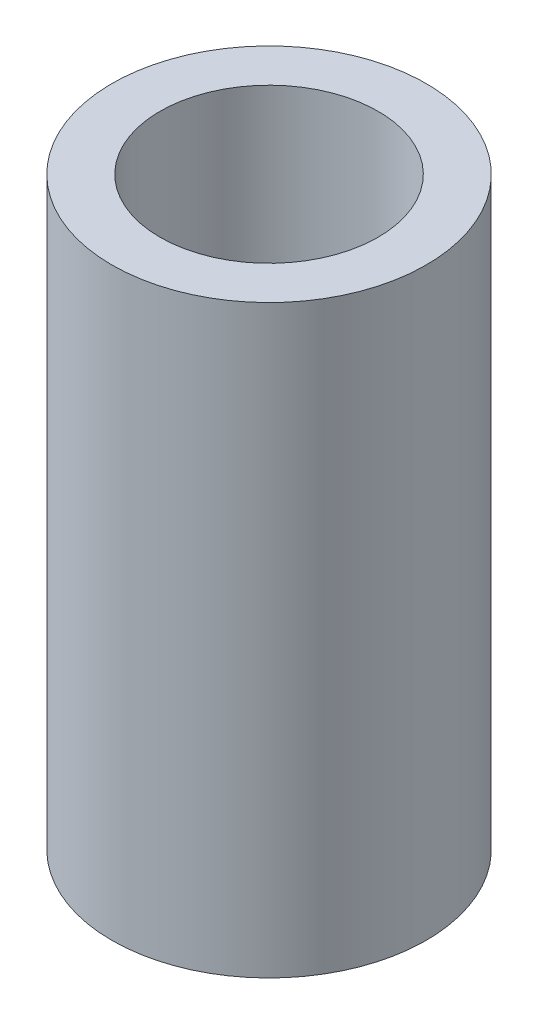
ISO-10303-21;
HEADER;
FILE_DESCRIPTION(('STEP AP214'),'2;1');
FILE_NAME('part.step','',(''),(''),'','','');
FILE_SCHEMA(('AUTOMOTIVE_DESIGN { 1 0 10303 214 1 1 1 1 }'));
ENDSEC;
DATA;
#1=APPLICATION_CONTEXT('core data for automotive mechanical design processes');
#2=APPLICATION_PROTOCOL_DEFINITION('international standard','automotive_design',2000,#1);
#3=PRODUCT_CONTEXT('',#1,'mechanical');
#4=PRODUCT('Part','Part','',(#3));
#5=PRODUCT_RELATED_PRODUCT_CATEGORY('part','',(#4));
#6=PRODUCT_DEFINITION_FORMATION('','',#4);
#7=PRODUCT_DEFINITION_CONTEXT('part definition',#1,'design');
#8=PRODUCT_DEFINITION('design','',#6,#7);
#9=PRODUCT_DEFINITION_SHAPE('','',#8);
#10=(LENGTH_UNIT() NAMED_UNIT(*) SI_UNIT(.MILLI.,.METRE.));
#11=(NAMED_UNIT(*) PLANE_ANGLE_UNIT() SI_UNIT($,.RADIAN.));
#12=(NAMED_UNIT(*) SI_UNIT($,.STERADIAN.) SOLID_ANGLE_UNIT());
#13=UNCERTAINTY_MEASURE_WITH_UNIT(LENGTH_MEASURE(1.E-05),#10,'distance_accuracy_value','');
#14=(GEOMETRIC_REPRESENTATION_CONTEXT(3) GLOBAL_UNCERTAINTY_ASSIGNED_CONTEXT((#13)) GLOBAL_UNIT_ASSIGNED_CONTEXT((#10,
#11,#12)) REPRESENTATION_CONTEXT('',''));
#15=CARTESIAN_POINT('',(0.,0.,0.));
#16=DIRECTION('',(0.,0.,1.));
#17=DIRECTION('',(1.,0.,0.));
#18=AXIS2_PLACEMENT_3D('',#15,#16,#17);
#19=CARTESIAN_POINT('',(0.,46.5232520482608,0.));
#20=DIRECTION('',(0.,-1.,0.));
#21=DIRECTION('',(0.,0.,-1.));
#22=AXIS2_PLACEMENT_3D('',#19,#20,#21);
#23=CYLINDRICAL_SURFACE('',#22,12.5);
#24=CARTESIAN_POINT('',(0.,46.5232520482608,0.));
#25=DIRECTION('',(0.,1.,0.));
#26=DIRECTION('',(0.,0.,1.));
#27=AXIS2_PLACEMENT_3D('',#24,#25,#26);
#28=CIRCLE('',#27,12.5);
#29=CARTESIAN_POINT('',(0.,46.5232520482608,12.5));
#30=VERTEX_POINT('',#29);
#31=EDGE_CURVE('E10',#30,#30,#28,.T.);
#32=ORIENTED_EDGE('',*,*,#31,.F.);
#33=EDGE_LOOP('',(#32));
#34=FACE_BOUND('',#33,.T.);
#35=CARTESIAN_POINT('',(0.,0.,0.));
#36=DIRECTION('',(0.,1.,0.));
#37=DIRECTION('',(0.,0.,1.));
#38=AXIS2_PLACEMENT_3D('',#35,#36,#37);
#39=CIRCLE('',#38,12.5);
#40=CARTESIAN_POINT('',(0.,0.,12.5));
#41=VERTEX_POINT('',#40);
#42=EDGE_CURVE('E37',#41,#41,#39,.T.);
#43=ORIENTED_EDGE('',*,*,#42,.T.);
#44=EDGE_LOOP('',(#43));
#45=FACE_BOUND('',#44,.T.);
#46=ADVANCED_FACE('F40',(#34,#45),#23,.T.);
#47=CARTESIAN_POINT('',(0.,46.5232520482608,0.));
#48=DIRECTION('',(0.,1.,0.));
#49=DIRECTION('',(0.,0.,1.));
#50=AXIS2_PLACEMENT_3D('',#47,#48,#49);
#51=PLANE('',#50);
#52=CARTESIAN_POINT('',(0.,46.5232520482608,0.));
#53=DIRECTION('',(0.,1.,0.));
#54=DIRECTION('',(0.,0.,1.));
#55=AXIS2_PLACEMENT_3D('',#52,#53,#54);
#56=CIRCLE('',#55,8.67770806605417);
#57=CARTESIAN_POINT('',(0.,46.5232520482608,8.67770806605417));
#58=VERTEX_POINT('',#57);
#59=EDGE_CURVE('E50',#58,#58,#56,.T.);
#60=ORIENTED_EDGE('',*,*,#59,.F.);
#61=EDGE_LOOP('',(#60));
#62=FACE_BOUND('',#61,.T.);
#63=ORIENTED_EDGE('',*,*,#31,.T.);
#64=EDGE_LOOP('',(#63));
#65=FACE_BOUND('',#64,.T.);
#66=ADVANCED_FACE('F59',(#62,#65),#51,.T.);
#67=CARTESIAN_POINT('',(0.,0.,0.));
#68=DIRECTION('',(0.,1.,0.));
#69=DIRECTION('',(0.,0.,1.));
#70=AXIS2_PLACEMENT_3D('',#67,#68,#69);
#71=PLANE('',#70);
#72=CARTESIAN_POINT('',(0.,0.,0.));
#73=DIRECTION('',(0.,1.,0.));
#74=DIRECTION('',(0.,0.,1.));
#75=AXIS2_PLACEMENT_3D('',#72,#73,#74);
#76=CIRCLE('',#75,8.67770806605417);
#77=CARTESIAN_POINT('',(0.,0.,8.67770806605417));
#78=VERTEX_POINT('',#77);
#79=EDGE_CURVE('E47',#78,#78,#76,.T.);
#80=ORIENTED_EDGE('',*,*,#79,.T.);
#81=EDGE_LOOP('',(#80));
#82=FACE_BOUND('',#81,.T.);
#83=ORIENTED_EDGE('',*,*,#42,.F.);
#84=EDGE_LOOP('',(#83));
#85=FACE_BOUND('',#84,.T.);
#86=ADVANCED_FACE('F58',(#82,#85),#71,.F.);
#87=CARTESIAN_POINT('',(0.,46.5232520482608,0.));
#88=DIRECTION('',(0.,-1.,0.));
#89=DIRECTION('',(0.,0.,-1.));
#90=AXIS2_PLACEMENT_3D('',#87,#88,#89);
#91=CYLINDRICAL_SURFACE('',#90,8.67770806605417);
#92=ORIENTED_EDGE('',*,*,#59,.T.);
#93=EDGE_LOOP('',(#92));
#94=FACE_BOUND('',#93,.T.);
#95=ORIENTED_EDGE('',*,*,#79,.F.);
#96=EDGE_LOOP('',(#95));
#97=FACE_BOUND('',#96,.T.);
#98=ADVANCED_FACE('F54',(#94,#97),#91,.F.);
#99=CLOSED_SHELL('',(#46,#66,#86,#98));
#100=MANIFOLD_SOLID_BREP('B2',#99);
#101=ADVANCED_BREP_SHAPE_REPRESENTATION('',(#18,#100),#14);
#102=SHAPE_DEFINITION_REPRESENTATION(#9,#101);
ENDSEC;
END-ISO-10303-21;
